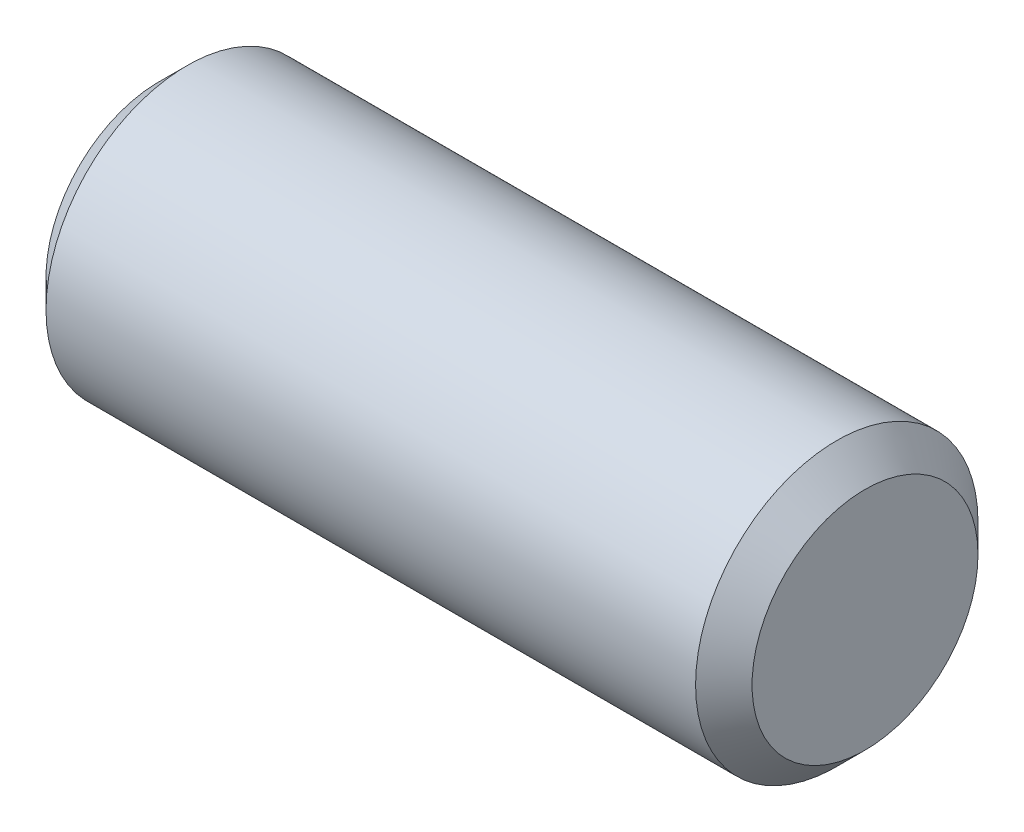
ISO-10303-21;
HEADER;
FILE_DESCRIPTION(('STEP AP214'),'2;1');
FILE_NAME('part.step','',(''),(''),'','','');
FILE_SCHEMA(('AUTOMOTIVE_DESIGN { 1 0 10303 214 1 1 1 1 }'));
ENDSEC;
DATA;
#1=APPLICATION_CONTEXT('core data for automotive mechanical design processes');
#2=APPLICATION_PROTOCOL_DEFINITION('international standard','automotive_design',2000,#1);
#3=PRODUCT_CONTEXT('',#1,'mechanical');
#4=PRODUCT('Part','Part','',(#3));
#5=PRODUCT_RELATED_PRODUCT_CATEGORY('part','',(#4));
#6=PRODUCT_DEFINITION_FORMATION('','',#4);
#7=PRODUCT_DEFINITION_CONTEXT('part definition',#1,'design');
#8=PRODUCT_DEFINITION('design','',#6,#7);
#9=PRODUCT_DEFINITION_SHAPE('','',#8);
#10=(LENGTH_UNIT() NAMED_UNIT(*) SI_UNIT(.MILLI.,.METRE.));
#11=(NAMED_UNIT(*) PLANE_ANGLE_UNIT() SI_UNIT($,.RADIAN.));
#12=(NAMED_UNIT(*) SI_UNIT($,.STERADIAN.) SOLID_ANGLE_UNIT());
#13=UNCERTAINTY_MEASURE_WITH_UNIT(LENGTH_MEASURE(1.E-05),#10,'distance_accuracy_value','');
#14=(GEOMETRIC_REPRESENTATION_CONTEXT(3) GLOBAL_UNCERTAINTY_ASSIGNED_CONTEXT((#13)) GLOBAL_UNIT_ASSIGNED_CONTEXT((#10,
#11,#12)) REPRESENTATION_CONTEXT('',''));
#15=CARTESIAN_POINT('',(0.,0.,0.));
#16=DIRECTION('',(0.,0.,1.));
#17=DIRECTION('',(1.,0.,0.));
#18=AXIS2_PLACEMENT_3D('',#15,#16,#17);
#19=CARTESIAN_POINT('',(-7.9375,0.,0.));
#20=DIRECTION('',(1.,0.,0.));
#21=DIRECTION('',(0.,0.,-1.));
#22=AXIS2_PLACEMENT_3D('',#19,#20,#21);
#23=CYLINDRICAL_SURFACE('',#22,3.175);
#24=CARTESIAN_POINT('',(7.3025,0.,0.));
#25=DIRECTION('',(1.,0.,0.));
#26=DIRECTION('',(0.,0.,-1.));
#27=AXIS2_PLACEMENT_3D('',#24,#25,#26);
#28=CIRCLE('',#27,3.175);
#29=CARTESIAN_POINT('',(7.3025,0.,-3.17500000000001));
#30=VERTEX_POINT('',#29);
#31=EDGE_CURVE('E41',#30,#30,#28,.F.);
#32=ORIENTED_EDGE('',*,*,#31,.T.);
#33=EDGE_LOOP('',(#32));
#34=FACE_BOUND('',#33,.T.);
#35=CARTESIAN_POINT('',(-7.3025,0.,0.));
#36=DIRECTION('',(1.,0.,0.));
#37=DIRECTION('',(0.,0.,-1.));
#38=AXIS2_PLACEMENT_3D('',#35,#36,#37);
#39=CIRCLE('',#38,3.175);
#40=CARTESIAN_POINT('',(-7.3025,0.,-3.17500000000001));
#41=VERTEX_POINT('',#40);
#42=EDGE_CURVE('E45',#41,#41,#39,.T.);
#43=ORIENTED_EDGE('',*,*,#42,.T.);
#44=EDGE_LOOP('',(#43));
#45=FACE_BOUND('',#44,.T.);
#46=ADVANCED_FACE('F34',(#34,#45),#23,.T.);
#47=CARTESIAN_POINT('',(-7.9375,0.,0.));
#48=DIRECTION('',(1.,0.,0.));
#49=DIRECTION('',(0.,0.,-1.));
#50=AXIS2_PLACEMENT_3D('',#47,#48,#49);
#51=PLANE('',#50);
#52=CARTESIAN_POINT('',(-7.9375,0.,0.));
#53=DIRECTION('',(1.,0.,0.));
#54=DIRECTION('',(0.,0.,-1.));
#55=AXIS2_PLACEMENT_3D('',#52,#53,#54);
#56=CIRCLE('',#55,2.54);
#57=CARTESIAN_POINT('',(-7.9375,0.,-2.54000000000001));
#58=VERTEX_POINT('',#57);
#59=EDGE_CURVE('E10',#58,#58,#56,.F.);
#60=ORIENTED_EDGE('',*,*,#59,.T.);
#61=EDGE_LOOP('',(#60));
#62=FACE_BOUND('',#61,.T.);
#63=ADVANCED_FACE('F65',(#62),#51,.F.);
#64=CARTESIAN_POINT('',(7.9375,0.,0.));
#65=DIRECTION('',(1.,0.,0.));
#66=DIRECTION('',(0.,0.,-1.));
#67=AXIS2_PLACEMENT_3D('',#64,#65,#66);
#68=PLANE('',#67);
#69=CARTESIAN_POINT('',(7.9375,0.,0.));
#70=DIRECTION('',(1.,0.,0.));
#71=DIRECTION('',(0.,0.,-1.));
#72=AXIS2_PLACEMENT_3D('',#69,#70,#71);
#73=CIRCLE('',#72,2.54);
#74=CARTESIAN_POINT('',(7.9375,0.,-2.54000000000001));
#75=VERTEX_POINT('',#74);
#76=EDGE_CURVE('E49',#75,#75,#73,.T.);
#77=ORIENTED_EDGE('',*,*,#76,.T.);
#78=EDGE_LOOP('',(#77));
#79=FACE_BOUND('',#78,.T.);
#80=ADVANCED_FACE('F55',(#79),#68,.T.);
#81=CARTESIAN_POINT('',(7.9375,0.,0.));
#82=DIRECTION('',(-1.,0.,0.));
#83=DIRECTION('',(0.,0.,1.));
#84=AXIS2_PLACEMENT_3D('',#81,#82,#83);
#85=CONICAL_SURFACE('',#84,2.54,0.785398163397448);
#86=ORIENTED_EDGE('',*,*,#31,.F.);
#87=EDGE_LOOP('',(#86));
#88=FACE_BOUND('',#87,.T.);
#89=ORIENTED_EDGE('',*,*,#76,.F.);
#90=EDGE_LOOP('',(#89));
#91=FACE_BOUND('',#90,.T.);
#92=ADVANCED_FACE('F57',(#88,#91),#85,.T.);
#93=CARTESIAN_POINT('',(-7.3025,0.,0.));
#94=DIRECTION('',(1.,0.,0.));
#95=DIRECTION('',(0.,0.,-1.));
#96=AXIS2_PLACEMENT_3D('',#93,#94,#95);
#97=CONICAL_SURFACE('',#96,3.175,0.785398163397449);
#98=ORIENTED_EDGE('',*,*,#59,.F.);
#99=EDGE_LOOP('',(#98));
#100=FACE_BOUND('',#99,.T.);
#101=ORIENTED_EDGE('',*,*,#42,.F.);
#102=EDGE_LOOP('',(#101));
#103=FACE_BOUND('',#102,.T.);
#104=ADVANCED_FACE('F36',(#100,#103),#97,.T.);
#105=CLOSED_SHELL('',(#46,#63,#80,#92,#104));
#106=MANIFOLD_SOLID_BREP('B2',#105);
#107=ADVANCED_BREP_SHAPE_REPRESENTATION('',(#18,#106),#14);
#108=SHAPE_DEFINITION_REPRESENTATION(#9,#107);
ENDSEC;
END-ISO-10303-21;
